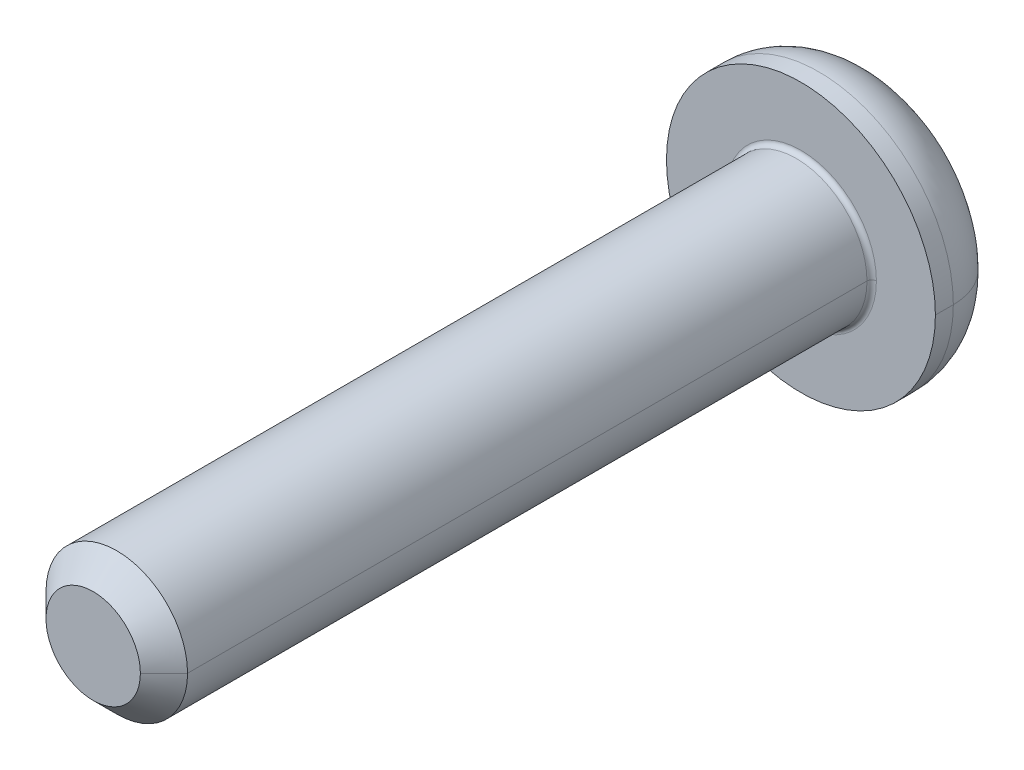
ISO-10303-21;
HEADER;
FILE_DESCRIPTION(('STEP AP214'),'2;1');
FILE_NAME('part.step','',(''),(''),'','','');
FILE_SCHEMA(('AUTOMOTIVE_DESIGN { 1 0 10303 214 1 1 1 1 }'));
ENDSEC;
DATA;
#1=APPLICATION_CONTEXT('core data for automotive mechanical design processes');
#2=APPLICATION_PROTOCOL_DEFINITION('international standard','automotive_design',2000,#1);
#3=PRODUCT_CONTEXT('',#1,'mechanical');
#4=PRODUCT('Part','Part','',(#3));
#5=PRODUCT_RELATED_PRODUCT_CATEGORY('part','',(#4));
#6=PRODUCT_DEFINITION_FORMATION('','',#4);
#7=PRODUCT_DEFINITION_CONTEXT('part definition',#1,'design');
#8=PRODUCT_DEFINITION('design','',#6,#7);
#9=PRODUCT_DEFINITION_SHAPE('','',#8);
#10=(LENGTH_UNIT() NAMED_UNIT(*) SI_UNIT(.MILLI.,.METRE.));
#11=(NAMED_UNIT(*) PLANE_ANGLE_UNIT() SI_UNIT($,.RADIAN.));
#12=(NAMED_UNIT(*) SI_UNIT($,.STERADIAN.) SOLID_ANGLE_UNIT());
#13=UNCERTAINTY_MEASURE_WITH_UNIT(LENGTH_MEASURE(1.E-05),#10,'distance_accuracy_value','');
#14=(GEOMETRIC_REPRESENTATION_CONTEXT(3) GLOBAL_UNCERTAINTY_ASSIGNED_CONTEXT((#13)) GLOBAL_UNIT_ASSIGNED_CONTEXT((#10,
#11,#12)) REPRESENTATION_CONTEXT('',''));
#15=CARTESIAN_POINT('',(0.,0.,0.));
#16=DIRECTION('',(0.,0.,1.));
#17=DIRECTION('',(1.,0.,0.));
#18=AXIS2_PLACEMENT_3D('',#15,#16,#17);
#19=CARTESIAN_POINT('',(0.,0.,0.1));
#20=DIRECTION('',(0.,0.,-1.));
#21=DIRECTION('',(-1.,0.,0.));
#22=AXIS2_PLACEMENT_3D('',#19,#20,#21);
#23=TOROIDAL_SURFACE('',#22,1.6,0.1);
#24=CARTESIAN_POINT('',(1.6,0.,0.1));
#25=DIRECTION('',(0.,1.,0.));
#26=DIRECTION('',(-1.,0.,0.));
#27=AXIS2_PLACEMENT_3D('',#24,#25,#26);
#28=CIRCLE('',#27,0.1);
#29=CARTESIAN_POINT('',(1.6,0.,0.));
#30=VERTEX_POINT('',#29);
#31=CARTESIAN_POINT('',(1.5,0.,0.1));
#32=VERTEX_POINT('',#31);
#33=EDGE_CURVE('E298',#30,#32,#28,.T.);
#34=ORIENTED_EDGE('',*,*,#33,.F.);
#35=CARTESIAN_POINT('',(0.,0.,0.));
#36=DIRECTION('',(0.,0.,-1.));
#37=DIRECTION('',(-1.,0.,0.));
#38=AXIS2_PLACEMENT_3D('',#35,#36,#37);
#39=CIRCLE('',#38,1.6);
#40=CARTESIAN_POINT('',(-1.6,0.,0.));
#41=VERTEX_POINT('',#40);
#42=EDGE_CURVE('E259',#41,#30,#39,.T.);
#43=ORIENTED_EDGE('',*,*,#42,.F.);
#44=CARTESIAN_POINT('',(-1.6,0.,0.1));
#45=DIRECTION('',(0.,-1.,0.));
#46=DIRECTION('',(0.,0.,-1.));
#47=AXIS2_PLACEMENT_3D('',#44,#45,#46);
#48=CIRCLE('',#47,0.1);
#49=CARTESIAN_POINT('',(-1.5,0.,0.1));
#50=VERTEX_POINT('',#49);
#51=EDGE_CURVE('E175',#41,#50,#48,.T.);
#52=ORIENTED_EDGE('',*,*,#51,.T.);
#53=CARTESIAN_POINT('',(0.,0.,0.1));
#54=DIRECTION('',(0.,0.,1.));
#55=DIRECTION('',(-1.,0.,0.));
#56=AXIS2_PLACEMENT_3D('',#53,#54,#55);
#57=CIRCLE('',#56,1.5);
#58=EDGE_CURVE('E189',#32,#50,#57,.T.);
#59=ORIENTED_EDGE('',*,*,#58,.F.);
#60=EDGE_LOOP('',(#34,#43,#52,#59));
#61=FACE_BOUND('',#60,.T.);
#62=ADVANCED_FACE('F17',(#61),#23,.F.);
#63=CARTESIAN_POINT('',(0.,0.,-0.38));
#64=DIRECTION('',(0.,0.,-1.));
#65=DIRECTION('',(-1.,0.,0.));
#66=AXIS2_PLACEMENT_3D('',#63,#64,#65);
#67=TOROIDAL_SURFACE('',#66,1.58,1.27);
#68=CARTESIAN_POINT('',(1.58,0.,-0.38));
#69=DIRECTION('',(0.,1.,0.));
#70=DIRECTION('',(-1.,0.,0.));
#71=AXIS2_PLACEMENT_3D('',#68,#69,#70);
#72=CIRCLE('',#71,1.27);
#73=CARTESIAN_POINT('',(2.85,0.,-0.38));
#74=VERTEX_POINT('',#73);
#75=CARTESIAN_POINT('',(1.58,0.,-1.65));
#76=VERTEX_POINT('',#75);
#77=EDGE_CURVE('E184',#74,#76,#72,.T.);
#78=ORIENTED_EDGE('',*,*,#77,.F.);
#79=CARTESIAN_POINT('',(0.,0.,-0.38));
#80=DIRECTION('',(0.,0.,1.));
#81=DIRECTION('',(-1.,0.,0.));
#82=AXIS2_PLACEMENT_3D('',#79,#80,#81);
#83=CIRCLE('',#82,2.85);
#84=CARTESIAN_POINT('',(-2.85,0.,-0.38));
#85=VERTEX_POINT('',#84);
#86=EDGE_CURVE('E229',#85,#74,#83,.T.);
#87=ORIENTED_EDGE('',*,*,#86,.F.);
#88=CARTESIAN_POINT('',(-1.58,0.,-0.38));
#89=DIRECTION('',(0.,-1.,0.));
#90=DIRECTION('',(0.,0.,-1.));
#91=AXIS2_PLACEMENT_3D('',#88,#89,#90);
#92=CIRCLE('',#91,1.27);
#93=CARTESIAN_POINT('',(-1.58,0.,-1.65));
#94=VERTEX_POINT('',#93);
#95=EDGE_CURVE('E195',#85,#94,#92,.T.);
#96=ORIENTED_EDGE('',*,*,#95,.T.);
#97=CARTESIAN_POINT('',(0.,0.,-1.65));
#98=DIRECTION('',(0.,0.,-1.));
#99=DIRECTION('',(-1.,0.,0.));
#100=AXIS2_PLACEMENT_3D('',#97,#98,#99);
#101=CIRCLE('',#100,1.58);
#102=EDGE_CURVE('E235',#76,#94,#101,.T.);
#103=ORIENTED_EDGE('',*,*,#102,.F.);
#104=EDGE_LOOP('',(#78,#87,#96,#103));
#105=FACE_BOUND('',#104,.T.);
#106=ADVANCED_FACE('F359',(#105),#67,.T.);
#107=CARTESIAN_POINT('',(0.,0.,-0.61));
#108=DIRECTION('',(0.,0.,-1.));
#109=DIRECTION('',(0.,-1.,0.));
#110=AXIS2_PLACEMENT_3D('',#107,#108,#109);
#111=PLANE('',#110);
#112=DIRECTION('',(-1.,0.,0.));
#113=VECTOR('',#112,1.);
#114=CARTESIAN_POINT('',(0.577350269189626,-1.,-0.61));
#115=LINE('',#114,#113);
#116=CARTESIAN_POINT('',(0.577350269189626,-1.,-0.61));
#117=VERTEX_POINT('',#116);
#118=CARTESIAN_POINT('',(-0.577350269189626,-1.,-0.61));
#119=VERTEX_POINT('',#118);
#120=EDGE_CURVE('E268',#117,#119,#115,.T.);
#121=ORIENTED_EDGE('',*,*,#120,.T.);
#122=DIRECTION('',(-0.5,0.866025403784439,0.));
#123=VECTOR('',#122,1.);
#124=CARTESIAN_POINT('',(-0.577350269189626,-1.,-0.61));
#125=LINE('',#124,#123);
#126=CARTESIAN_POINT('',(-1.15470053837925,0.,-0.61));
#127=VERTEX_POINT('',#126);
#128=EDGE_CURVE('E11',#119,#127,#125,.T.);
#129=ORIENTED_EDGE('',*,*,#128,.T.);
#130=DIRECTION('',(0.5,0.866025403784439,0.));
#131=VECTOR('',#130,1.);
#132=CARTESIAN_POINT('',(-1.15470053837925,0.,-0.61));
#133=LINE('',#132,#131);
#134=CARTESIAN_POINT('',(-0.577350269189626,1.,-0.61));
#135=VERTEX_POINT('',#134);
#136=EDGE_CURVE('E143',#127,#135,#133,.T.);
#137=ORIENTED_EDGE('',*,*,#136,.T.);
#138=DIRECTION('',(1.,0.,0.));
#139=VECTOR('',#138,1.);
#140=CARTESIAN_POINT('',(-0.577350269189626,1.,-0.61));
#141=LINE('',#140,#139);
#142=CARTESIAN_POINT('',(0.577350269189626,1.,-0.61));
#143=VERTEX_POINT('',#142);
#144=EDGE_CURVE('E136',#135,#143,#141,.T.);
#145=ORIENTED_EDGE('',*,*,#144,.T.);
#146=DIRECTION('',(0.5,-0.866025403784439,0.));
#147=VECTOR('',#146,1.);
#148=CARTESIAN_POINT('',(0.577350269189626,1.,-0.61));
#149=LINE('',#148,#147);
#150=CARTESIAN_POINT('',(1.15470053837925,0.,-0.61));
#151=VERTEX_POINT('',#150);
#152=EDGE_CURVE('E140',#143,#151,#149,.T.);
#153=ORIENTED_EDGE('',*,*,#152,.T.);
#154=DIRECTION('',(-0.5,-0.866025403784439,0.));
#155=VECTOR('',#154,1.);
#156=CARTESIAN_POINT('',(1.15470053837925,0.,-0.61));
#157=LINE('',#156,#155);
#158=EDGE_CURVE('E169',#151,#117,#157,.T.);
#159=ORIENTED_EDGE('',*,*,#158,.T.);
#160=EDGE_LOOP('',(#121,#129,#137,#145,#153,#159));
#161=FACE_BOUND('',#160,.T.);
#162=ADVANCED_FACE('F138',(#161),#111,.T.);
#163=CARTESIAN_POINT('',(-0.577350269189626,-1.,-0.61));
#164=DIRECTION('',(-0.866025403784439,-0.5,0.));
#165=DIRECTION('',(-0.5,0.866025403784439,0.));
#166=AXIS2_PLACEMENT_3D('',#163,#164,#165);
#167=PLANE('',#166);
#168=DIRECTION('',(-0.5,0.866025403784439,0.));
#169=VECTOR('',#168,1.);
#170=CARTESIAN_POINT('',(-0.577350269189626,-1.,-1.65));
#171=LINE('',#170,#169);
#172=CARTESIAN_POINT('',(-0.577350269189626,-1.,-1.65));
#173=VERTEX_POINT('',#172);
#174=CARTESIAN_POINT('',(-1.15470053837925,0.,-1.65));
#175=VERTEX_POINT('',#174);
#176=EDGE_CURVE('E255',#173,#175,#171,.T.);
#177=ORIENTED_EDGE('',*,*,#176,.T.);
#178=DIRECTION('',(0.,0.,-1.));
#179=VECTOR('',#178,1.);
#180=CARTESIAN_POINT('',(-1.15470053837925,0.,-0.61));
#181=LINE('',#180,#179);
#182=EDGE_CURVE('E26',#127,#175,#181,.T.);
#183=ORIENTED_EDGE('',*,*,#182,.F.);
#184=ORIENTED_EDGE('',*,*,#128,.F.);
#185=DIRECTION('',(0.,0.,-1.));
#186=VECTOR('',#185,1.);
#187=CARTESIAN_POINT('',(-0.577350269189626,-1.,-0.61));
#188=LINE('',#187,#186);
#189=EDGE_CURVE('E265',#119,#173,#188,.T.);
#190=ORIENTED_EDGE('',*,*,#189,.T.);
#191=EDGE_LOOP('',(#177,#183,#184,#190));
#192=FACE_BOUND('',#191,.T.);
#193=ADVANCED_FACE('F280',(#192),#167,.F.);
#194=CARTESIAN_POINT('',(-1.15470053837925,0.,-0.61));
#195=DIRECTION('',(-0.866025403784439,0.5,0.));
#196=DIRECTION('',(0.,0.,1.));
#197=AXIS2_PLACEMENT_3D('',#194,#195,#196);
#198=PLANE('',#197);
#199=DIRECTION('',(0.5,0.866025403784439,0.));
#200=VECTOR('',#199,1.);
#201=CARTESIAN_POINT('',(-1.15470053837925,0.,-1.65));
#202=LINE('',#201,#200);
#203=CARTESIAN_POINT('',(-0.577350269189626,1.,-1.65));
#204=VERTEX_POINT('',#203);
#205=EDGE_CURVE('E251',#175,#204,#202,.T.);
#206=ORIENTED_EDGE('',*,*,#205,.T.);
#207=DIRECTION('',(0.,0.,-1.));
#208=VECTOR('',#207,1.);
#209=CARTESIAN_POINT('',(-0.577350269189626,1.,-0.61));
#210=LINE('',#209,#208);
#211=EDGE_CURVE('E147',#135,#204,#210,.T.);
#212=ORIENTED_EDGE('',*,*,#211,.F.);
#213=ORIENTED_EDGE('',*,*,#136,.F.);
#214=ORIENTED_EDGE('',*,*,#182,.T.);
#215=EDGE_LOOP('',(#206,#212,#213,#214));
#216=FACE_BOUND('',#215,.T.);
#217=ADVANCED_FACE('F276',(#216),#198,.F.);
#218=CARTESIAN_POINT('',(-0.577350269189626,1.,-0.61));
#219=DIRECTION('',(0.,1.,0.));
#220=DIRECTION('',(1.,0.,0.));
#221=AXIS2_PLACEMENT_3D('',#218,#219,#220);
#222=PLANE('',#221);
#223=DIRECTION('',(1.,0.,0.));
#224=VECTOR('',#223,1.);
#225=CARTESIAN_POINT('',(-0.577350269189626,1.,-1.65));
#226=LINE('',#225,#224);
#227=CARTESIAN_POINT('',(0.577350269189626,1.,-1.65));
#228=VERTEX_POINT('',#227);
#229=EDGE_CURVE('E153',#204,#228,#226,.T.);
#230=ORIENTED_EDGE('',*,*,#229,.T.);
#231=DIRECTION('',(0.,0.,-1.));
#232=VECTOR('',#231,1.);
#233=CARTESIAN_POINT('',(0.577350269189626,1.,-0.61));
#234=LINE('',#233,#232);
#235=EDGE_CURVE('E148',#143,#228,#234,.T.);
#236=ORIENTED_EDGE('',*,*,#235,.F.);
#237=ORIENTED_EDGE('',*,*,#144,.F.);
#238=ORIENTED_EDGE('',*,*,#211,.T.);
#239=EDGE_LOOP('',(#230,#236,#237,#238));
#240=FACE_BOUND('',#239,.T.);
#241=ADVANCED_FACE('F151',(#240),#222,.F.);
#242=CARTESIAN_POINT('',(0.577350269189626,1.,-0.61));
#243=DIRECTION('',(0.866025403784439,0.5,0.));
#244=DIRECTION('',(0.,0.,-1.));
#245=AXIS2_PLACEMENT_3D('',#242,#243,#244);
#246=PLANE('',#245);
#247=DIRECTION('',(0.5,-0.866025403784439,0.));
#248=VECTOR('',#247,1.);
#249=CARTESIAN_POINT('',(0.577350269189626,1.,-1.65));
#250=LINE('',#249,#248);
#251=CARTESIAN_POINT('',(1.15470053837925,0.,-1.65));
#252=VERTEX_POINT('',#251);
#253=EDGE_CURVE('E246',#228,#252,#250,.T.);
#254=ORIENTED_EDGE('',*,*,#253,.T.);
#255=DIRECTION('',(0.,0.,-1.));
#256=VECTOR('',#255,1.);
#257=CARTESIAN_POINT('',(1.15470053837925,0.,-0.61));
#258=LINE('',#257,#256);
#259=EDGE_CURVE('E160',#151,#252,#258,.T.);
#260=ORIENTED_EDGE('',*,*,#259,.F.);
#261=ORIENTED_EDGE('',*,*,#152,.F.);
#262=ORIENTED_EDGE('',*,*,#235,.T.);
#263=EDGE_LOOP('',(#254,#260,#261,#262));
#264=FACE_BOUND('',#263,.T.);
#265=ADVANCED_FACE('F159',(#264),#246,.F.);
#266=CARTESIAN_POINT('',(1.15470053837925,0.,-0.61));
#267=DIRECTION('',(0.866025403784439,-0.5,0.));
#268=DIRECTION('',(0.,0.,-1.));
#269=AXIS2_PLACEMENT_3D('',#266,#267,#268);
#270=PLANE('',#269);
#271=DIRECTION('',(-0.5,-0.866025403784439,0.));
#272=VECTOR('',#271,1.);
#273=CARTESIAN_POINT('',(1.15470053837925,0.,-1.65));
#274=LINE('',#273,#272);
#275=CARTESIAN_POINT('',(0.577350269189626,-1.,-1.65));
#276=VERTEX_POINT('',#275);
#277=EDGE_CURVE('E242',#252,#276,#274,.T.);
#278=ORIENTED_EDGE('',*,*,#277,.T.);
#279=DIRECTION('',(0.,0.,-1.));
#280=VECTOR('',#279,1.);
#281=CARTESIAN_POINT('',(0.577350269189626,-1.,-0.61));
#282=LINE('',#281,#280);
#283=EDGE_CURVE('E262',#117,#276,#282,.T.);
#284=ORIENTED_EDGE('',*,*,#283,.F.);
#285=ORIENTED_EDGE('',*,*,#158,.F.);
#286=ORIENTED_EDGE('',*,*,#259,.T.);
#287=EDGE_LOOP('',(#278,#284,#285,#286));
#288=FACE_BOUND('',#287,.T.);
#289=ADVANCED_FACE('F289',(#288),#270,.F.);
#290=CARTESIAN_POINT('',(0.577350269189626,-1.,-0.61));
#291=DIRECTION('',(0.,-1.,0.));
#292=DIRECTION('',(-1.,0.,0.));
#293=AXIS2_PLACEMENT_3D('',#290,#291,#292);
#294=PLANE('',#293);
#295=DIRECTION('',(-1.,0.,0.));
#296=VECTOR('',#295,1.);
#297=CARTESIAN_POINT('',(0.577350269189626,-1.,-1.65));
#298=LINE('',#297,#296);
#299=EDGE_CURVE('E238',#276,#173,#298,.T.);
#300=ORIENTED_EDGE('',*,*,#299,.T.);
#301=ORIENTED_EDGE('',*,*,#189,.F.);
#302=ORIENTED_EDGE('',*,*,#120,.F.);
#303=ORIENTED_EDGE('',*,*,#283,.T.);
#304=EDGE_LOOP('',(#300,#301,#302,#303));
#305=FACE_BOUND('',#304,.T.);
#306=ADVANCED_FACE('F292',(#305),#294,.F.);
#307=CARTESIAN_POINT('',(0.,0.,0.));
#308=DIRECTION('',(0.,0.,-1.));
#309=DIRECTION('',(0.,-1.,0.));
#310=AXIS2_PLACEMENT_3D('',#307,#308,#309);
#311=PLANE('',#310);
#312=ORIENTED_EDGE('',*,*,#42,.T.);
#313=CARTESIAN_POINT('',(0.,0.,0.));
#314=DIRECTION('',(0.,0.,-1.));
#315=DIRECTION('',(-1.,0.,0.));
#316=AXIS2_PLACEMENT_3D('',#313,#314,#315);
#317=CIRCLE('',#316,1.6);
#318=EDGE_CURVE('E301',#30,#41,#317,.T.);
#319=ORIENTED_EDGE('',*,*,#318,.T.);
#320=EDGE_LOOP('',(#312,#319));
#321=FACE_BOUND('',#320,.T.);
#322=CARTESIAN_POINT('',(0.,0.,0.));
#323=DIRECTION('',(0.,0.,-1.));
#324=DIRECTION('',(-1.,0.,0.));
#325=AXIS2_PLACEMENT_3D('',#322,#323,#324);
#326=CIRCLE('',#325,2.85);
#327=CARTESIAN_POINT('',(2.85,0.,0.));
#328=VERTEX_POINT('',#327);
#329=CARTESIAN_POINT('',(-2.85,0.,0.));
#330=VERTEX_POINT('',#329);
#331=EDGE_CURVE('E232',#328,#330,#326,.T.);
#332=ORIENTED_EDGE('',*,*,#331,.F.);
#333=CARTESIAN_POINT('',(0.,0.,0.));
#334=DIRECTION('',(0.,0.,-1.));
#335=DIRECTION('',(-1.,0.,0.));
#336=AXIS2_PLACEMENT_3D('',#333,#334,#335);
#337=CIRCLE('',#336,2.85);
#338=EDGE_CURVE('E203',#330,#328,#337,.T.);
#339=ORIENTED_EDGE('',*,*,#338,.F.);
#340=EDGE_LOOP('',(#332,#339));
#341=FACE_BOUND('',#340,.T.);
#342=ADVANCED_FACE('F341',(#321,#341),#311,.F.);
#343=CARTESIAN_POINT('',(0.,0.,-1.65));
#344=DIRECTION('',(0.,0.,-1.));
#345=DIRECTION('',(0.,-1.,0.));
#346=AXIS2_PLACEMENT_3D('',#343,#344,#345);
#347=PLANE('',#346);
#348=ORIENTED_EDGE('',*,*,#299,.F.);
#349=ORIENTED_EDGE('',*,*,#277,.F.);
#350=ORIENTED_EDGE('',*,*,#253,.F.);
#351=ORIENTED_EDGE('',*,*,#229,.F.);
#352=ORIENTED_EDGE('',*,*,#205,.F.);
#353=ORIENTED_EDGE('',*,*,#176,.F.);
#354=EDGE_LOOP('',(#348,#349,#350,#351,#352,#353));
#355=FACE_BOUND('',#354,.T.);
#356=CARTESIAN_POINT('',(0.,0.,-1.65));
#357=DIRECTION('',(0.,0.,-1.));
#358=DIRECTION('',(-1.,0.,0.));
#359=AXIS2_PLACEMENT_3D('',#356,#357,#358);
#360=CIRCLE('',#359,1.58);
#361=EDGE_CURVE('E191',#94,#76,#360,.T.);
#362=ORIENTED_EDGE('',*,*,#361,.T.);
#363=ORIENTED_EDGE('',*,*,#102,.T.);
#364=EDGE_LOOP('',(#362,#363));
#365=FACE_BOUND('',#364,.T.);
#366=ADVANCED_FACE('F284',(#355,#365),#347,.T.);
#367=CARTESIAN_POINT('',(0.,0.,-1.65));
#368=DIRECTION('',(0.,0.,1.));
#369=DIRECTION('',(1.,0.,0.));
#370=AXIS2_PLACEMENT_3D('',#367,#368,#369);
#371=CYLINDRICAL_SURFACE('',#370,2.85);
#372=DIRECTION('',(0.,0.,1.));
#373=VECTOR('',#372,1.);
#374=CARTESIAN_POINT('',(-2.85,0.,-1.65));
#375=LINE('',#374,#373);
#376=EDGE_CURVE('E199',#85,#330,#375,.T.);
#377=ORIENTED_EDGE('',*,*,#376,.F.);
#378=ORIENTED_EDGE('',*,*,#86,.T.);
#379=DIRECTION('',(0.,0.,1.));
#380=VECTOR('',#379,1.);
#381=CARTESIAN_POINT('',(2.85,0.,-1.65));
#382=LINE('',#381,#380);
#383=EDGE_CURVE('E212',#74,#328,#382,.T.);
#384=ORIENTED_EDGE('',*,*,#383,.T.);
#385=ORIENTED_EDGE('',*,*,#331,.T.);
#386=EDGE_LOOP('',(#377,#378,#384,#385));
#387=FACE_BOUND('',#386,.T.);
#388=ADVANCED_FACE('F349',(#387),#371,.T.);
#389=CARTESIAN_POINT('',(0.,0.,15.));
#390=DIRECTION('',(0.,0.,-1.));
#391=DIRECTION('',(-1.,0.,0.));
#392=AXIS2_PLACEMENT_3D('',#389,#390,#391);
#393=CONICAL_SURFACE('',#392,1.,0.785398163397446);
#394=DIRECTION('',(0.707106781186546,0.,-0.70710678118655));
#395=VECTOR('',#394,1.);
#396=CARTESIAN_POINT('',(1.,0.,15.));
#397=LINE('',#396,#395);
#398=CARTESIAN_POINT('',(1.,0.,15.));
#399=VERTEX_POINT('',#398);
#400=CARTESIAN_POINT('',(1.5,0.,14.5));
#401=VERTEX_POINT('',#400);
#402=EDGE_CURVE('E208',#399,#401,#397,.T.);
#403=ORIENTED_EDGE('',*,*,#402,.F.);
#404=CARTESIAN_POINT('',(0.,0.,15.));
#405=DIRECTION('',(0.,0.,1.));
#406=DIRECTION('',(1.,0.,0.));
#407=AXIS2_PLACEMENT_3D('',#404,#405,#406);
#408=CIRCLE('',#407,1.);
#409=CARTESIAN_POINT('',(-1.,0.,15.));
#410=VERTEX_POINT('',#409);
#411=EDGE_CURVE('E226',#410,#399,#408,.T.);
#412=ORIENTED_EDGE('',*,*,#411,.F.);
#413=DIRECTION('',(-0.707106781186546,0.,-0.70710678118655));
#414=VECTOR('',#413,1.);
#415=CARTESIAN_POINT('',(-1.,0.,15.));
#416=LINE('',#415,#414);
#417=CARTESIAN_POINT('',(-1.5,0.,14.5));
#418=VERTEX_POINT('',#417);
#419=EDGE_CURVE('E190',#410,#418,#416,.T.);
#420=ORIENTED_EDGE('',*,*,#419,.T.);
#421=CARTESIAN_POINT('',(0.,0.,14.5));
#422=DIRECTION('',(0.,0.,-1.));
#423=DIRECTION('',(1.,0.,0.));
#424=AXIS2_PLACEMENT_3D('',#421,#422,#423);
#425=CIRCLE('',#424,1.5);
#426=EDGE_CURVE('E223',#401,#418,#425,.T.);
#427=ORIENTED_EDGE('',*,*,#426,.F.);
#428=EDGE_LOOP('',(#403,#412,#420,#427));
#429=FACE_BOUND('',#428,.T.);
#430=ADVANCED_FACE('F322',(#429),#393,.T.);
#431=CARTESIAN_POINT('',(0.,0.,15.));
#432=DIRECTION('',(0.,0.,1.));
#433=DIRECTION('',(1.,0.,0.));
#434=AXIS2_PLACEMENT_3D('',#431,#432,#433);
#435=PLANE('',#434);
#436=ORIENTED_EDGE('',*,*,#411,.T.);
#437=CARTESIAN_POINT('',(0.,0.,15.));
#438=DIRECTION('',(0.,0.,1.));
#439=DIRECTION('',(1.,0.,0.));
#440=AXIS2_PLACEMENT_3D('',#437,#438,#439);
#441=CIRCLE('',#440,1.);
#442=EDGE_CURVE('E216',#399,#410,#441,.T.);
#443=ORIENTED_EDGE('',*,*,#442,.T.);
#444=EDGE_LOOP('',(#436,#443));
#445=FACE_BOUND('',#444,.T.);
#446=ADVANCED_FACE('F391',(#445),#435,.T.);
#447=CARTESIAN_POINT('',(0.,0.,15.));
#448=DIRECTION('',(0.,0.,-1.));
#449=DIRECTION('',(-1.,0.,0.));
#450=AXIS2_PLACEMENT_3D('',#447,#448,#449);
#451=CYLINDRICAL_SURFACE('',#450,1.5);
#452=DIRECTION('',(0.,0.,-1.));
#453=VECTOR('',#452,1.);
#454=CARTESIAN_POINT('',(1.5,0.,15.));
#455=LINE('',#454,#453);
#456=EDGE_CURVE('E185',#401,#32,#455,.T.);
#457=ORIENTED_EDGE('',*,*,#456,.F.);
#458=ORIENTED_EDGE('',*,*,#426,.T.);
#459=DIRECTION('',(0.,0.,-1.));
#460=VECTOR('',#459,1.);
#461=CARTESIAN_POINT('',(-1.5,0.,15.));
#462=LINE('',#461,#460);
#463=EDGE_CURVE('E220',#418,#50,#462,.T.);
#464=ORIENTED_EDGE('',*,*,#463,.T.);
#465=CARTESIAN_POINT('',(0.,0.,0.1));
#466=DIRECTION('',(0.,0.,1.));
#467=DIRECTION('',(-1.,0.,0.));
#468=AXIS2_PLACEMENT_3D('',#465,#466,#467);
#469=CIRCLE('',#468,1.5);
#470=EDGE_CURVE('E173',#50,#32,#469,.T.);
#471=ORIENTED_EDGE('',*,*,#470,.T.);
#472=EDGE_LOOP('',(#457,#458,#464,#471));
#473=FACE_BOUND('',#472,.T.);
#474=ADVANCED_FACE('F332',(#473),#451,.T.);
#475=CARTESIAN_POINT('',(0.,0.,15.));
#476=DIRECTION('',(0.,0.,-1.));
#477=DIRECTION('',(-1.,0.,0.));
#478=AXIS2_PLACEMENT_3D('',#475,#476,#477);
#479=CYLINDRICAL_SURFACE('',#478,1.5);
#480=CARTESIAN_POINT('',(0.,0.,14.5));
#481=DIRECTION('',(0.,0.,-1.));
#482=DIRECTION('',(1.,0.,0.));
#483=AXIS2_PLACEMENT_3D('',#480,#481,#482);
#484=CIRCLE('',#483,1.5);
#485=EDGE_CURVE('E204',#418,#401,#484,.T.);
#486=ORIENTED_EDGE('',*,*,#485,.T.);
#487=ORIENTED_EDGE('',*,*,#456,.T.);
#488=ORIENTED_EDGE('',*,*,#58,.T.);
#489=ORIENTED_EDGE('',*,*,#463,.F.);
#490=EDGE_LOOP('',(#486,#487,#488,#489));
#491=FACE_BOUND('',#490,.T.);
#492=ADVANCED_FACE('F329',(#491),#479,.T.);
#493=CARTESIAN_POINT('',(0.,0.,15.));
#494=DIRECTION('',(0.,0.,-1.));
#495=DIRECTION('',(-1.,0.,0.));
#496=AXIS2_PLACEMENT_3D('',#493,#494,#495);
#497=CONICAL_SURFACE('',#496,1.,0.785398163397446);
#498=ORIENTED_EDGE('',*,*,#442,.F.);
#499=ORIENTED_EDGE('',*,*,#402,.T.);
#500=ORIENTED_EDGE('',*,*,#485,.F.);
#501=ORIENTED_EDGE('',*,*,#419,.F.);
#502=EDGE_LOOP('',(#498,#499,#500,#501));
#503=FACE_BOUND('',#502,.T.);
#504=ADVANCED_FACE('F326',(#503),#497,.T.);
#505=CARTESIAN_POINT('',(0.,0.,-1.65));
#506=DIRECTION('',(0.,0.,1.));
#507=DIRECTION('',(1.,0.,0.));
#508=AXIS2_PLACEMENT_3D('',#505,#506,#507);
#509=CYLINDRICAL_SURFACE('',#508,2.85);
#510=CARTESIAN_POINT('',(0.,0.,-0.38));
#511=DIRECTION('',(0.,0.,1.));
#512=DIRECTION('',(-1.,0.,0.));
#513=AXIS2_PLACEMENT_3D('',#510,#511,#512);
#514=CIRCLE('',#513,2.85);
#515=EDGE_CURVE('E178',#74,#85,#514,.T.);
#516=ORIENTED_EDGE('',*,*,#515,.T.);
#517=ORIENTED_EDGE('',*,*,#376,.T.);
#518=ORIENTED_EDGE('',*,*,#338,.T.);
#519=ORIENTED_EDGE('',*,*,#383,.F.);
#520=EDGE_LOOP('',(#516,#517,#518,#519));
#521=FACE_BOUND('',#520,.T.);
#522=ADVANCED_FACE('F352',(#521),#509,.T.);
#523=CARTESIAN_POINT('',(0.,0.,-0.38));
#524=DIRECTION('',(0.,0.,-1.));
#525=DIRECTION('',(-1.,0.,0.));
#526=AXIS2_PLACEMENT_3D('',#523,#524,#525);
#527=TOROIDAL_SURFACE('',#526,1.58,1.27);
#528=ORIENTED_EDGE('',*,*,#515,.F.);
#529=ORIENTED_EDGE('',*,*,#77,.T.);
#530=ORIENTED_EDGE('',*,*,#361,.F.);
#531=ORIENTED_EDGE('',*,*,#95,.F.);
#532=EDGE_LOOP('',(#528,#529,#530,#531));
#533=FACE_BOUND('',#532,.T.);
#534=ADVANCED_FACE('F357',(#533),#527,.T.);
#535=CARTESIAN_POINT('',(0.,0.,0.1));
#536=DIRECTION('',(0.,0.,-1.));
#537=DIRECTION('',(-1.,0.,0.));
#538=AXIS2_PLACEMENT_3D('',#535,#536,#537);
#539=TOROIDAL_SURFACE('',#538,1.6,0.1);
#540=ORIENTED_EDGE('',*,*,#318,.F.);
#541=ORIENTED_EDGE('',*,*,#33,.T.);
#542=ORIENTED_EDGE('',*,*,#470,.F.);
#543=ORIENTED_EDGE('',*,*,#51,.F.);
#544=EDGE_LOOP('',(#540,#541,#542,#543));
#545=FACE_BOUND('',#544,.T.);
#546=ADVANCED_FACE('F338',(#545),#539,.F.);
#547=CLOSED_SHELL('',(#62,#106,#162,#193,#217,#241,#265,#289,#306,#342,#366,#388,#430,#446,#474,
#492,#504,#522,#534,#546));
#548=MANIFOLD_SOLID_BREP('B1',#547);
#549=ADVANCED_BREP_SHAPE_REPRESENTATION('',(#18,#548),#14);
#550=SHAPE_DEFINITION_REPRESENTATION(#9,#549);
ENDSEC;
END-ISO-10303-21;
